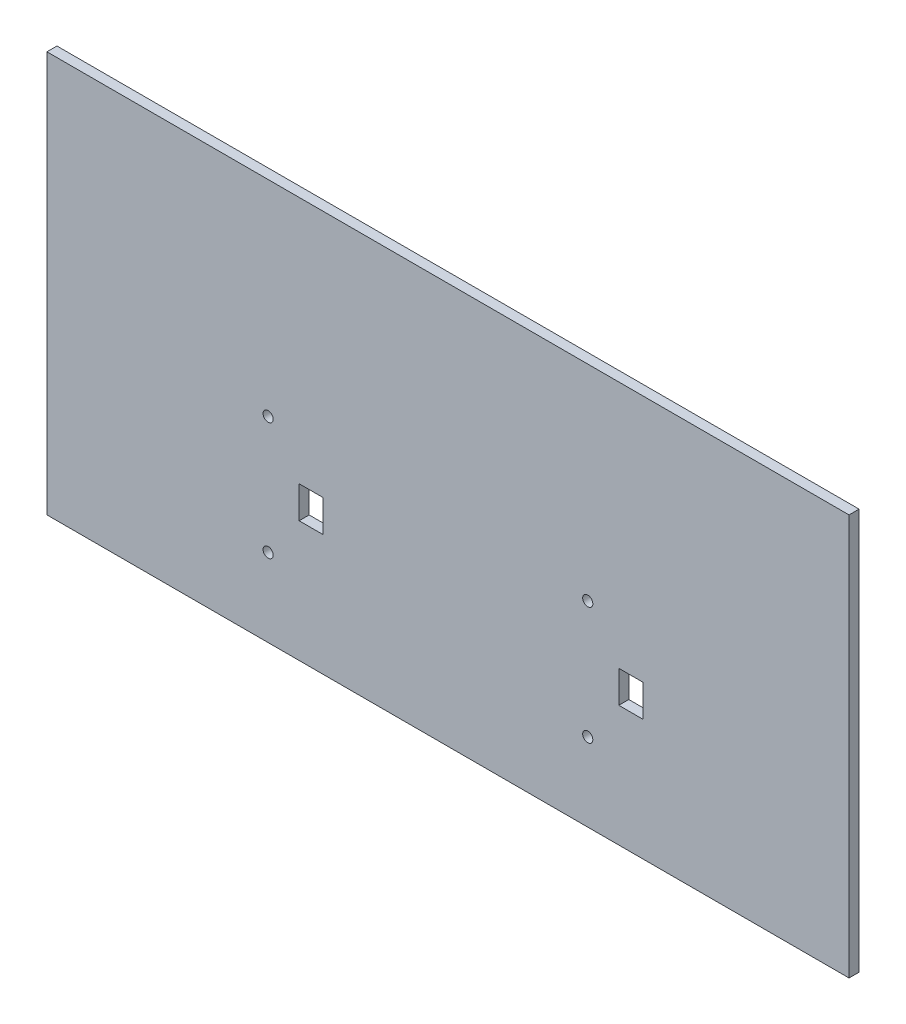
ISO-10303-21;
HEADER;
FILE_DESCRIPTION(('STEP AP214'),'2;1');
FILE_NAME('part.step','',(''),(''),'','','');
FILE_SCHEMA(('AUTOMOTIVE_DESIGN { 1 0 10303 214 1 1 1 1 }'));
ENDSEC;
DATA;
#1=APPLICATION_CONTEXT('core data for automotive mechanical design processes');
#2=APPLICATION_PROTOCOL_DEFINITION('international standard','automotive_design',2000,#1);
#3=PRODUCT_CONTEXT('',#1,'mechanical');
#4=PRODUCT('Part','Part','',(#3));
#5=PRODUCT_RELATED_PRODUCT_CATEGORY('part','',(#4));
#6=PRODUCT_DEFINITION_FORMATION('','',#4);
#7=PRODUCT_DEFINITION_CONTEXT('part definition',#1,'design');
#8=PRODUCT_DEFINITION('design','',#6,#7);
#9=PRODUCT_DEFINITION_SHAPE('','',#8);
#10=(LENGTH_UNIT() NAMED_UNIT(*) SI_UNIT(.MILLI.,.METRE.));
#11=(NAMED_UNIT(*) PLANE_ANGLE_UNIT() SI_UNIT($,.RADIAN.));
#12=(NAMED_UNIT(*) SI_UNIT($,.STERADIAN.) SOLID_ANGLE_UNIT());
#13=UNCERTAINTY_MEASURE_WITH_UNIT(LENGTH_MEASURE(1.E-05),#10,'distance_accuracy_value','');
#14=(GEOMETRIC_REPRESENTATION_CONTEXT(3) GLOBAL_UNCERTAINTY_ASSIGNED_CONTEXT((#13)) GLOBAL_UNIT_ASSIGNED_CONTEXT((#10,
#11,#12)) REPRESENTATION_CONTEXT('',''));
#15=CARTESIAN_POINT('',(0.,0.,0.));
#16=DIRECTION('',(0.,0.,1.));
#17=DIRECTION('',(1.,0.,0.));
#18=AXIS2_PLACEMENT_3D('',#15,#16,#17);
#19=CARTESIAN_POINT('',(127.,-63.5,1.5875));
#20=DIRECTION('',(-1.,0.,0.));
#21=DIRECTION('',(0.,0.,1.));
#22=AXIS2_PLACEMENT_3D('',#19,#20,#21);
#23=PLANE('',#22);
#24=DIRECTION('',(0.,1.,0.));
#25=VECTOR('',#24,1.);
#26=CARTESIAN_POINT('',(127.,-63.5,-1.5875));
#27=LINE('',#26,#25);
#28=CARTESIAN_POINT('',(127.,-63.5,-1.5875));
#29=VERTEX_POINT('',#28);
#30=CARTESIAN_POINT('',(127.,63.5,-1.5875));
#31=VERTEX_POINT('',#30);
#32=EDGE_CURVE('E194',#29,#31,#27,.T.);
#33=ORIENTED_EDGE('',*,*,#32,.T.);
#34=DIRECTION('',(0.,0.,-1.));
#35=VECTOR('',#34,1.);
#36=CARTESIAN_POINT('',(127.,63.5,1.5875));
#37=LINE('',#36,#35);
#38=CARTESIAN_POINT('',(127.,63.5,1.5875));
#39=VERTEX_POINT('',#38);
#40=EDGE_CURVE('E211',#39,#31,#37,.T.);
#41=ORIENTED_EDGE('',*,*,#40,.F.);
#42=DIRECTION('',(0.,1.,0.));
#43=VECTOR('',#42,1.);
#44=CARTESIAN_POINT('',(127.,-63.5,1.5875));
#45=LINE('',#44,#43);
#46=CARTESIAN_POINT('',(127.,-63.5,1.5875));
#47=VERTEX_POINT('',#46);
#48=EDGE_CURVE('E183',#47,#39,#45,.T.);
#49=ORIENTED_EDGE('',*,*,#48,.F.);
#50=DIRECTION('',(0.,0.,-1.));
#51=VECTOR('',#50,1.);
#52=CARTESIAN_POINT('',(127.,-63.5,1.5875));
#53=LINE('',#52,#51);
#54=EDGE_CURVE('E193',#47,#29,#53,.T.);
#55=ORIENTED_EDGE('',*,*,#54,.T.);
#56=EDGE_LOOP('',(#33,#41,#49,#55));
#57=FACE_BOUND('',#56,.T.);
#58=ADVANCED_FACE('F39',(#57),#23,.F.);
#59=CARTESIAN_POINT('',(-127.,63.5,1.5875));
#60=DIRECTION('',(0.,-1.,0.));
#61=DIRECTION('',(0.,0.,-1.));
#62=AXIS2_PLACEMENT_3D('',#59,#60,#61);
#63=PLANE('',#62);
#64=DIRECTION('',(-1.,0.,0.));
#65=VECTOR('',#64,1.);
#66=CARTESIAN_POINT('',(-127.,63.5,-1.5875));
#67=LINE('',#66,#65);
#68=CARTESIAN_POINT('',(-127.,63.5,-1.5875));
#69=VERTEX_POINT('',#68);
#70=EDGE_CURVE('E197',#31,#69,#67,.T.);
#71=ORIENTED_EDGE('',*,*,#70,.T.);
#72=DIRECTION('',(0.,0.,-1.));
#73=VECTOR('',#72,1.);
#74=CARTESIAN_POINT('',(-127.,63.5,1.5875));
#75=LINE('',#74,#73);
#76=CARTESIAN_POINT('',(-127.,63.5,1.5875));
#77=VERTEX_POINT('',#76);
#78=EDGE_CURVE('E208',#77,#69,#75,.T.);
#79=ORIENTED_EDGE('',*,*,#78,.F.);
#80=DIRECTION('',(-1.,0.,0.));
#81=VECTOR('',#80,1.);
#82=CARTESIAN_POINT('',(-127.,63.5,1.5875));
#83=LINE('',#82,#81);
#84=EDGE_CURVE('E186',#39,#77,#83,.T.);
#85=ORIENTED_EDGE('',*,*,#84,.F.);
#86=ORIENTED_EDGE('',*,*,#40,.T.);
#87=EDGE_LOOP('',(#71,#79,#85,#86));
#88=FACE_BOUND('',#87,.T.);
#89=ADVANCED_FACE('F270',(#88),#63,.F.);
#90=CARTESIAN_POINT('',(-127.,-63.5,1.5875));
#91=DIRECTION('',(1.,0.,0.));
#92=DIRECTION('',(0.,0.,-1.));
#93=AXIS2_PLACEMENT_3D('',#90,#91,#92);
#94=PLANE('',#93);
#95=DIRECTION('',(0.,-1.,0.));
#96=VECTOR('',#95,1.);
#97=CARTESIAN_POINT('',(-127.,-63.5,-1.5875));
#98=LINE('',#97,#96);
#99=CARTESIAN_POINT('',(-127.,-63.5,-1.5875));
#100=VERTEX_POINT('',#99);
#101=EDGE_CURVE('E200',#69,#100,#98,.T.);
#102=ORIENTED_EDGE('',*,*,#101,.T.);
#103=DIRECTION('',(0.,0.,-1.));
#104=VECTOR('',#103,1.);
#105=CARTESIAN_POINT('',(-127.,-63.5,1.5875));
#106=LINE('',#105,#104);
#107=CARTESIAN_POINT('',(-127.,-63.5,1.5875));
#108=VERTEX_POINT('',#107);
#109=EDGE_CURVE('E205',#108,#100,#106,.T.);
#110=ORIENTED_EDGE('',*,*,#109,.F.);
#111=DIRECTION('',(0.,-1.,0.));
#112=VECTOR('',#111,1.);
#113=CARTESIAN_POINT('',(-127.,-63.5,1.5875));
#114=LINE('',#113,#112);
#115=EDGE_CURVE('E189',#77,#108,#114,.T.);
#116=ORIENTED_EDGE('',*,*,#115,.F.);
#117=ORIENTED_EDGE('',*,*,#78,.T.);
#118=EDGE_LOOP('',(#102,#110,#116,#117));
#119=FACE_BOUND('',#118,.T.);
#120=ADVANCED_FACE('F265',(#119),#94,.F.);
#121=CARTESIAN_POINT('',(-127.,-63.5,1.5875));
#122=DIRECTION('',(0.,1.,0.));
#123=DIRECTION('',(0.,0.,1.));
#124=AXIS2_PLACEMENT_3D('',#121,#122,#123);
#125=PLANE('',#124);
#126=DIRECTION('',(1.,0.,0.));
#127=VECTOR('',#126,1.);
#128=CARTESIAN_POINT('',(-127.,-63.5,-1.5875));
#129=LINE('',#128,#127);
#130=EDGE_CURVE('E187',#100,#29,#129,.T.);
#131=ORIENTED_EDGE('',*,*,#130,.T.);
#132=ORIENTED_EDGE('',*,*,#54,.F.);
#133=DIRECTION('',(1.,0.,0.));
#134=VECTOR('',#133,1.);
#135=CARTESIAN_POINT('',(-127.,-63.5,1.5875));
#136=LINE('',#135,#134);
#137=EDGE_CURVE('E191',#108,#47,#136,.T.);
#138=ORIENTED_EDGE('',*,*,#137,.F.);
#139=ORIENTED_EDGE('',*,*,#109,.T.);
#140=EDGE_LOOP('',(#131,#132,#138,#139));
#141=FACE_BOUND('',#140,.T.);
#142=ADVANCED_FACE('F256',(#141),#125,.F.);
#143=CARTESIAN_POINT('',(0.,0.,1.5875));
#144=DIRECTION('',(0.,0.,-1.));
#145=DIRECTION('',(-1.,0.,0.));
#146=AXIS2_PLACEMENT_3D('',#143,#144,#145);
#147=PLANE('',#146);
#148=DIRECTION('',(0.,-1.,0.));
#149=VECTOR('',#148,1.);
#150=CARTESIAN_POINT('',(54.0800000012263,-15.025,1.5875));
#151=LINE('',#150,#149);
#152=CARTESIAN_POINT('',(54.0800000012263,-15.025,1.5875));
#153=VERTEX_POINT('',#152);
#154=CARTESIAN_POINT('',(54.0800000012264,-25.175,1.5875));
#155=VERTEX_POINT('',#154);
#156=EDGE_CURVE('E161',#153,#155,#151,.T.);
#157=ORIENTED_EDGE('',*,*,#156,.F.);
#158=DIRECTION('',(-1.,0.,0.));
#159=VECTOR('',#158,1.);
#160=CARTESIAN_POINT('',(54.0800000012263,-15.025,1.5875));
#161=LINE('',#160,#159);
#162=CARTESIAN_POINT('',(61.7000000012264,-15.025,1.5875));
#163=VERTEX_POINT('',#162);
#164=EDGE_CURVE('E53',#163,#153,#161,.T.);
#165=ORIENTED_EDGE('',*,*,#164,.F.);
#166=DIRECTION('',(0.,1.,0.));
#167=VECTOR('',#166,1.);
#168=CARTESIAN_POINT('',(61.7000000012264,-15.025,1.5875));
#169=LINE('',#168,#167);
#170=CARTESIAN_POINT('',(61.7000000012264,-25.175,1.5875));
#171=VERTEX_POINT('',#170);
#172=EDGE_CURVE('E167',#171,#163,#169,.T.);
#173=ORIENTED_EDGE('',*,*,#172,.F.);
#174=DIRECTION('',(1.,0.,0.));
#175=VECTOR('',#174,1.);
#176=CARTESIAN_POINT('',(54.0800000012264,-25.175,1.5875));
#177=LINE('',#176,#175);
#178=EDGE_CURVE('E164',#155,#171,#177,.T.);
#179=ORIENTED_EDGE('',*,*,#178,.F.);
#180=EDGE_LOOP('',(#157,#165,#173,#179));
#181=FACE_BOUND('',#180,.T.);
#182=DIRECTION('',(0.,1.,0.));
#183=VECTOR('',#182,1.);
#184=CARTESIAN_POINT('',(-39.5100000179999,-25.175,1.5875));
#185=LINE('',#184,#183);
#186=CARTESIAN_POINT('',(-39.5100000179999,-25.175,1.5875));
#187=VERTEX_POINT('',#186);
#188=CARTESIAN_POINT('',(-39.5100000179999,-15.025,1.5875));
#189=VERTEX_POINT('',#188);
#190=EDGE_CURVE('E143',#187,#189,#185,.T.);
#191=ORIENTED_EDGE('',*,*,#190,.F.);
#192=DIRECTION('',(1.,0.,0.));
#193=VECTOR('',#192,1.);
#194=CARTESIAN_POINT('',(-47.130000018,-25.175,1.5875));
#195=LINE('',#194,#193);
#196=CARTESIAN_POINT('',(-47.130000018,-25.175,1.5875));
#197=VERTEX_POINT('',#196);
#198=EDGE_CURVE('E61',#197,#187,#195,.T.);
#199=ORIENTED_EDGE('',*,*,#198,.F.);
#200=DIRECTION('',(0.,-1.,0.));
#201=VECTOR('',#200,1.);
#202=CARTESIAN_POINT('',(-47.130000018,-25.175,1.5875));
#203=LINE('',#202,#201);
#204=CARTESIAN_POINT('',(-47.130000018,-15.025,1.5875));
#205=VERTEX_POINT('',#204);
#206=EDGE_CURVE('E150',#205,#197,#203,.T.);
#207=ORIENTED_EDGE('',*,*,#206,.F.);
#208=DIRECTION('',(-1.,0.,0.));
#209=VECTOR('',#208,1.);
#210=CARTESIAN_POINT('',(-47.130000018,-15.025,1.5875));
#211=LINE('',#210,#209);
#212=EDGE_CURVE('E133',#189,#205,#211,.T.);
#213=ORIENTED_EDGE('',*,*,#212,.F.);
#214=EDGE_LOOP('',(#191,#199,#207,#213));
#215=FACE_BOUND('',#214,.T.);
#216=CARTESIAN_POINT('',(44.2550000102264,-1.46000000000007,1.5875));
#217=DIRECTION('',(0.,0.,1.));
#218=DIRECTION('',(1.,0.,0.));
#219=AXIS2_PLACEMENT_3D('',#216,#217,#218);
#220=CIRCLE('',#219,1.61);
#221=CARTESIAN_POINT('',(45.8650000102264,-1.46000000000007,1.5875));
#222=VERTEX_POINT('',#221);
#223=EDGE_CURVE('E157',#222,#222,#220,.T.);
#224=ORIENTED_EDGE('',*,*,#223,.F.);
#225=EDGE_LOOP('',(#224));
#226=FACE_BOUND('',#225,.T.);
#227=CARTESIAN_POINT('',(44.2550000102264,-38.74,1.5875));
#228=DIRECTION('',(0.,0.,1.));
#229=DIRECTION('',(1.,0.,0.));
#230=AXIS2_PLACEMENT_3D('',#227,#228,#229);
#231=CIRCLE('',#230,1.61);
#232=CARTESIAN_POINT('',(45.8650000102264,-38.74,1.5875));
#233=VERTEX_POINT('',#232);
#234=EDGE_CURVE('E422',#233,#233,#231,.T.);
#235=ORIENTED_EDGE('',*,*,#234,.F.);
#236=EDGE_LOOP('',(#235));
#237=FACE_BOUND('',#236,.T.);
#238=CARTESIAN_POINT('',(-56.9550000089999,-38.74,1.5875));
#239=DIRECTION('',(0.,0.,1.));
#240=DIRECTION('',(1.,0.,0.));
#241=AXIS2_PLACEMENT_3D('',#238,#239,#240);
#242=CIRCLE('',#241,1.61000000000001);
#243=CARTESIAN_POINT('',(-55.3450000089999,-38.74,1.5875));
#244=VERTEX_POINT('',#243);
#245=EDGE_CURVE('E182',#244,#244,#242,.T.);
#246=ORIENTED_EDGE('',*,*,#245,.F.);
#247=EDGE_LOOP('',(#246));
#248=FACE_BOUND('',#247,.T.);
#249=CARTESIAN_POINT('',(-56.9550000089999,-1.46000000000006,1.5875));
#250=DIRECTION('',(0.,0.,1.));
#251=DIRECTION('',(1.,0.,0.));
#252=AXIS2_PLACEMENT_3D('',#249,#250,#251);
#253=CIRCLE('',#252,1.61);
#254=CARTESIAN_POINT('',(-55.3450000089999,-1.46000000000006,1.5875));
#255=VERTEX_POINT('',#254);
#256=EDGE_CURVE('E178',#255,#255,#253,.T.);
#257=ORIENTED_EDGE('',*,*,#256,.F.);
#258=EDGE_LOOP('',(#257));
#259=FACE_BOUND('',#258,.T.);
#260=ORIENTED_EDGE('',*,*,#48,.T.);
#261=ORIENTED_EDGE('',*,*,#84,.T.);
#262=ORIENTED_EDGE('',*,*,#115,.T.);
#263=ORIENTED_EDGE('',*,*,#137,.T.);
#264=EDGE_LOOP('',(#260,#261,#262,#263));
#265=FACE_BOUND('',#264,.T.);
#266=ADVANCED_FACE('F147',(#181,#215,#226,#237,#248,#259,#265),#147,.F.);
#267=CARTESIAN_POINT('',(0.,0.,-1.5875));
#268=DIRECTION('',(0.,0.,-1.));
#269=DIRECTION('',(-1.,0.,0.));
#270=AXIS2_PLACEMENT_3D('',#267,#268,#269);
#271=PLANE('',#270);
#272=DIRECTION('',(1.,0.,0.));
#273=VECTOR('',#272,1.);
#274=CARTESIAN_POINT('',(0.,-15.0250000000001,-1.5875));
#275=LINE('',#274,#273);
#276=CARTESIAN_POINT('',(54.0800000012263,-15.025,-1.5875));
#277=VERTEX_POINT('',#276);
#278=CARTESIAN_POINT('',(61.7000000012264,-15.025,-1.5875));
#279=VERTEX_POINT('',#278);
#280=EDGE_CURVE('E11',#277,#279,#275,.T.);
#281=ORIENTED_EDGE('',*,*,#280,.F.);
#282=DIRECTION('',(0.,1.,0.));
#283=VECTOR('',#282,1.);
#284=CARTESIAN_POINT('',(54.0800000012263,0.,-1.5875));
#285=LINE('',#284,#283);
#286=CARTESIAN_POINT('',(54.0800000012264,-25.175,-1.5875));
#287=VERTEX_POINT('',#286);
#288=EDGE_CURVE('E231',#287,#277,#285,.T.);
#289=ORIENTED_EDGE('',*,*,#288,.F.);
#290=DIRECTION('',(-1.,0.,0.));
#291=VECTOR('',#290,1.);
#292=CARTESIAN_POINT('',(0.,-25.1750000000001,-1.5875));
#293=LINE('',#292,#291);
#294=CARTESIAN_POINT('',(61.7000000012264,-25.175,-1.5875));
#295=VERTEX_POINT('',#294);
#296=EDGE_CURVE('E233',#295,#287,#293,.T.);
#297=ORIENTED_EDGE('',*,*,#296,.F.);
#298=DIRECTION('',(0.,-1.,0.));
#299=VECTOR('',#298,1.);
#300=CARTESIAN_POINT('',(61.7000000012264,0.,-1.5875));
#301=LINE('',#300,#299);
#302=EDGE_CURVE('E46',#279,#295,#301,.T.);
#303=ORIENTED_EDGE('',*,*,#302,.F.);
#304=EDGE_LOOP('',(#281,#289,#297,#303));
#305=FACE_BOUND('',#304,.T.);
#306=DIRECTION('',(-1.,0.,0.));
#307=VECTOR('',#306,1.);
#308=CARTESIAN_POINT('',(0.,-25.175,-1.5875));
#309=LINE('',#308,#307);
#310=CARTESIAN_POINT('',(-39.5100000179999,-25.175,-1.5875));
#311=VERTEX_POINT('',#310);
#312=CARTESIAN_POINT('',(-47.130000018,-25.175,-1.5875));
#313=VERTEX_POINT('',#312);
#314=EDGE_CURVE('E229',#311,#313,#309,.T.);
#315=ORIENTED_EDGE('',*,*,#314,.F.);
#316=DIRECTION('',(0.,-1.,0.));
#317=VECTOR('',#316,1.);
#318=CARTESIAN_POINT('',(-39.5100000179999,0.,-1.5875));
#319=LINE('',#318,#317);
#320=CARTESIAN_POINT('',(-39.5100000179999,-15.025,-1.5875));
#321=VERTEX_POINT('',#320);
#322=EDGE_CURVE('E214',#321,#311,#319,.T.);
#323=ORIENTED_EDGE('',*,*,#322,.F.);
#324=DIRECTION('',(1.,0.,0.));
#325=VECTOR('',#324,1.);
#326=CARTESIAN_POINT('',(0.,-15.025,-1.5875));
#327=LINE('',#326,#325);
#328=CARTESIAN_POINT('',(-47.130000018,-15.025,-1.5875));
#329=VERTEX_POINT('',#328);
#330=EDGE_CURVE('E136',#329,#321,#327,.T.);
#331=ORIENTED_EDGE('',*,*,#330,.F.);
#332=DIRECTION('',(0.,1.,0.));
#333=VECTOR('',#332,1.);
#334=CARTESIAN_POINT('',(-47.130000018,0.,-1.5875));
#335=LINE('',#334,#333);
#336=EDGE_CURVE('E227',#313,#329,#335,.T.);
#337=ORIENTED_EDGE('',*,*,#336,.F.);
#338=EDGE_LOOP('',(#315,#323,#331,#337));
#339=FACE_BOUND('',#338,.T.);
#340=CARTESIAN_POINT('',(44.2550000102264,-1.46000000000007,-1.5875));
#341=DIRECTION('',(0.,0.,-1.));
#342=DIRECTION('',(-1.,0.,0.));
#343=AXIS2_PLACEMENT_3D('',#340,#341,#342);
#344=CIRCLE('',#343,1.61);
#345=CARTESIAN_POINT('',(42.6450000102264,-1.46000000000007,-1.5875));
#346=VERTEX_POINT('',#345);
#347=EDGE_CURVE('E198',#346,#346,#344,.T.);
#348=ORIENTED_EDGE('',*,*,#347,.F.);
#349=EDGE_LOOP('',(#348));
#350=FACE_BOUND('',#349,.T.);
#351=CARTESIAN_POINT('',(44.2550000102264,-38.74,-1.5875));
#352=DIRECTION('',(0.,0.,-1.));
#353=DIRECTION('',(-1.,0.,0.));
#354=AXIS2_PLACEMENT_3D('',#351,#352,#353);
#355=CIRCLE('',#354,1.61);
#356=CARTESIAN_POINT('',(42.6450000102264,-38.74,-1.5875));
#357=VERTEX_POINT('',#356);
#358=EDGE_CURVE('E220',#357,#357,#355,.T.);
#359=ORIENTED_EDGE('',*,*,#358,.F.);
#360=EDGE_LOOP('',(#359));
#361=FACE_BOUND('',#360,.T.);
#362=CARTESIAN_POINT('',(-56.9550000089999,-38.74,-1.5875));
#363=DIRECTION('',(0.,0.,-1.));
#364=DIRECTION('',(-1.,0.,0.));
#365=AXIS2_PLACEMENT_3D('',#362,#363,#364);
#366=CIRCLE('',#365,1.61000000000001);
#367=CARTESIAN_POINT('',(-58.5650000089999,-38.74,-1.5875));
#368=VERTEX_POINT('',#367);
#369=EDGE_CURVE('E217',#368,#368,#366,.T.);
#370=ORIENTED_EDGE('',*,*,#369,.F.);
#371=EDGE_LOOP('',(#370));
#372=FACE_BOUND('',#371,.T.);
#373=CARTESIAN_POINT('',(-56.9550000089999,-1.46000000000006,-1.5875));
#374=DIRECTION('',(0.,0.,-1.));
#375=DIRECTION('',(-1.,0.,0.));
#376=AXIS2_PLACEMENT_3D('',#373,#374,#375);
#377=CIRCLE('',#376,1.61);
#378=CARTESIAN_POINT('',(-58.5650000089999,-1.46000000000006,-1.5875));
#379=VERTEX_POINT('',#378);
#380=EDGE_CURVE('E181',#379,#379,#377,.T.);
#381=ORIENTED_EDGE('',*,*,#380,.F.);
#382=EDGE_LOOP('',(#381));
#383=FACE_BOUND('',#382,.T.);
#384=ORIENTED_EDGE('',*,*,#32,.F.);
#385=ORIENTED_EDGE('',*,*,#130,.F.);
#386=ORIENTED_EDGE('',*,*,#101,.F.);
#387=ORIENTED_EDGE('',*,*,#70,.F.);
#388=EDGE_LOOP('',(#384,#385,#386,#387));
#389=FACE_BOUND('',#388,.T.);
#390=ADVANCED_FACE('F248',(#305,#339,#350,#361,#372,#383,#389),#271,.T.);
#391=CARTESIAN_POINT('',(-56.9550000089999,-1.46000000000006,-3.4925));
#392=DIRECTION('',(0.,0.,1.));
#393=DIRECTION('',(1.,0.,0.));
#394=AXIS2_PLACEMENT_3D('',#391,#392,#393);
#395=CYLINDRICAL_SURFACE('',#394,1.61);
#396=ORIENTED_EDGE('',*,*,#380,.T.);
#397=EDGE_LOOP('',(#396));
#398=FACE_BOUND('',#397,.T.);
#399=ORIENTED_EDGE('',*,*,#256,.T.);
#400=EDGE_LOOP('',(#399));
#401=FACE_BOUND('',#400,.T.);
#402=ADVANCED_FACE('F262',(#398,#401),#395,.F.);
#403=CARTESIAN_POINT('',(-56.9550000089999,-38.74,-3.4925));
#404=DIRECTION('',(0.,0.,1.));
#405=DIRECTION('',(1.,0.,0.));
#406=AXIS2_PLACEMENT_3D('',#403,#404,#405);
#407=CYLINDRICAL_SURFACE('',#406,1.61000000000001);
#408=ORIENTED_EDGE('',*,*,#369,.T.);
#409=EDGE_LOOP('',(#408));
#410=FACE_BOUND('',#409,.T.);
#411=ORIENTED_EDGE('',*,*,#245,.T.);
#412=EDGE_LOOP('',(#411));
#413=FACE_BOUND('',#412,.T.);
#414=ADVANCED_FACE('F315',(#410,#413),#407,.F.);
#415=CARTESIAN_POINT('',(44.2550000102264,-38.74,-3.4925));
#416=DIRECTION('',(0.,0.,1.));
#417=DIRECTION('',(1.,0.,0.));
#418=AXIS2_PLACEMENT_3D('',#415,#416,#417);
#419=CYLINDRICAL_SURFACE('',#418,1.61);
#420=ORIENTED_EDGE('',*,*,#358,.T.);
#421=EDGE_LOOP('',(#420));
#422=FACE_BOUND('',#421,.T.);
#423=ORIENTED_EDGE('',*,*,#234,.T.);
#424=EDGE_LOOP('',(#423));
#425=FACE_BOUND('',#424,.T.);
#426=ADVANCED_FACE('F321',(#422,#425),#419,.F.);
#427=CARTESIAN_POINT('',(44.2550000102264,-1.46000000000007,-3.4925));
#428=DIRECTION('',(0.,0.,1.));
#429=DIRECTION('',(1.,0.,0.));
#430=AXIS2_PLACEMENT_3D('',#427,#428,#429);
#431=CYLINDRICAL_SURFACE('',#430,1.61);
#432=ORIENTED_EDGE('',*,*,#347,.T.);
#433=EDGE_LOOP('',(#432));
#434=FACE_BOUND('',#433,.T.);
#435=ORIENTED_EDGE('',*,*,#223,.T.);
#436=EDGE_LOOP('',(#435));
#437=FACE_BOUND('',#436,.T.);
#438=ADVANCED_FACE('F329',(#434,#437),#431,.F.);
#439=CARTESIAN_POINT('',(-47.130000018,-25.175,-3.4925));
#440=DIRECTION('',(0.,-1.,0.));
#441=DIRECTION('',(0.,0.,-1.));
#442=AXIS2_PLACEMENT_3D('',#439,#440,#441);
#443=PLANE('',#442);
#444=ORIENTED_EDGE('',*,*,#314,.T.);
#445=DIRECTION('',(0.,0.,1.));
#446=VECTOR('',#445,1.);
#447=CARTESIAN_POINT('',(-47.130000018,-25.175,-3.4925));
#448=LINE('',#447,#446);
#449=EDGE_CURVE('E155',#313,#197,#448,.T.);
#450=ORIENTED_EDGE('',*,*,#449,.T.);
#451=ORIENTED_EDGE('',*,*,#198,.T.);
#452=DIRECTION('',(0.,0.,1.));
#453=VECTOR('',#452,1.);
#454=CARTESIAN_POINT('',(-39.5100000179999,-25.175,-3.4925));
#455=LINE('',#454,#453);
#456=EDGE_CURVE('E140',#311,#187,#455,.T.);
#457=ORIENTED_EDGE('',*,*,#456,.F.);
#458=EDGE_LOOP('',(#444,#450,#451,#457));
#459=FACE_BOUND('',#458,.T.);
#460=ADVANCED_FACE('F337',(#459),#443,.F.);
#461=CARTESIAN_POINT('',(-47.130000018,-25.175,-3.4925));
#462=DIRECTION('',(-1.,0.,0.));
#463=DIRECTION('',(0.,0.,1.));
#464=AXIS2_PLACEMENT_3D('',#461,#462,#463);
#465=PLANE('',#464);
#466=ORIENTED_EDGE('',*,*,#336,.T.);
#467=DIRECTION('',(0.,0.,1.));
#468=VECTOR('',#467,1.);
#469=CARTESIAN_POINT('',(-47.130000018,-15.025,-3.4925));
#470=LINE('',#469,#468);
#471=EDGE_CURVE('E139',#329,#205,#470,.T.);
#472=ORIENTED_EDGE('',*,*,#471,.T.);
#473=ORIENTED_EDGE('',*,*,#206,.T.);
#474=ORIENTED_EDGE('',*,*,#449,.F.);
#475=EDGE_LOOP('',(#466,#472,#473,#474));
#476=FACE_BOUND('',#475,.T.);
#477=ADVANCED_FACE('F345',(#476),#465,.F.);
#478=CARTESIAN_POINT('',(-47.130000018,-15.025,-3.4925));
#479=DIRECTION('',(0.,1.,0.));
#480=DIRECTION('',(0.,0.,1.));
#481=AXIS2_PLACEMENT_3D('',#478,#479,#480);
#482=PLANE('',#481);
#483=ORIENTED_EDGE('',*,*,#330,.T.);
#484=DIRECTION('',(0.,0.,1.));
#485=VECTOR('',#484,1.);
#486=CARTESIAN_POINT('',(-39.5100000179999,-15.025,-3.4925));
#487=LINE('',#486,#485);
#488=EDGE_CURVE('E128',#321,#189,#487,.T.);
#489=ORIENTED_EDGE('',*,*,#488,.T.);
#490=ORIENTED_EDGE('',*,*,#212,.T.);
#491=ORIENTED_EDGE('',*,*,#471,.F.);
#492=EDGE_LOOP('',(#483,#489,#490,#491));
#493=FACE_BOUND('',#492,.T.);
#494=ADVANCED_FACE('F130',(#493),#482,.F.);
#495=CARTESIAN_POINT('',(-39.5100000179999,-25.175,-3.4925));
#496=DIRECTION('',(1.,0.,0.));
#497=DIRECTION('',(0.,0.,-1.));
#498=AXIS2_PLACEMENT_3D('',#495,#496,#497);
#499=PLANE('',#498);
#500=ORIENTED_EDGE('',*,*,#322,.T.);
#501=ORIENTED_EDGE('',*,*,#456,.T.);
#502=ORIENTED_EDGE('',*,*,#190,.T.);
#503=ORIENTED_EDGE('',*,*,#488,.F.);
#504=EDGE_LOOP('',(#500,#501,#502,#503));
#505=FACE_BOUND('',#504,.T.);
#506=ADVANCED_FACE('F144',(#505),#499,.F.);
#507=CARTESIAN_POINT('',(54.0800000012263,-15.025,-3.4925));
#508=DIRECTION('',(0.,1.,0.));
#509=DIRECTION('',(-1.,0.,0.));
#510=AXIS2_PLACEMENT_3D('',#507,#508,#509);
#511=PLANE('',#510);
#512=ORIENTED_EDGE('',*,*,#280,.T.);
#513=DIRECTION('',(0.,0.,1.));
#514=VECTOR('',#513,1.);
#515=CARTESIAN_POINT('',(61.7000000012264,-15.025,-3.4925));
#516=LINE('',#515,#514);
#517=EDGE_CURVE('E171',#279,#163,#516,.T.);
#518=ORIENTED_EDGE('',*,*,#517,.T.);
#519=ORIENTED_EDGE('',*,*,#164,.T.);
#520=DIRECTION('',(0.,0.,1.));
#521=VECTOR('',#520,1.);
#522=CARTESIAN_POINT('',(54.0800000012263,-15.025,-3.4925));
#523=LINE('',#522,#521);
#524=EDGE_CURVE('E170',#277,#153,#523,.T.);
#525=ORIENTED_EDGE('',*,*,#524,.F.);
#526=EDGE_LOOP('',(#512,#518,#519,#525));
#527=FACE_BOUND('',#526,.T.);
#528=ADVANCED_FACE('F253',(#527),#511,.F.);
#529=CARTESIAN_POINT('',(61.7000000012264,-15.025,-3.4925));
#530=DIRECTION('',(1.,0.,0.));
#531=DIRECTION('',(0.,0.,-1.));
#532=AXIS2_PLACEMENT_3D('',#529,#530,#531);
#533=PLANE('',#532);
#534=ORIENTED_EDGE('',*,*,#302,.T.);
#535=DIRECTION('',(0.,0.,1.));
#536=VECTOR('',#535,1.);
#537=CARTESIAN_POINT('',(61.7000000012264,-25.175,-3.4925));
#538=LINE('',#537,#536);
#539=EDGE_CURVE('E173',#295,#171,#538,.T.);
#540=ORIENTED_EDGE('',*,*,#539,.T.);
#541=ORIENTED_EDGE('',*,*,#172,.T.);
#542=ORIENTED_EDGE('',*,*,#517,.F.);
#543=EDGE_LOOP('',(#534,#540,#541,#542));
#544=FACE_BOUND('',#543,.T.);
#545=ADVANCED_FACE('F239',(#544),#533,.F.);
#546=CARTESIAN_POINT('',(54.0800000012264,-25.175,-3.4925));
#547=DIRECTION('',(0.,-1.,0.));
#548=DIRECTION('',(1.,0.,0.));
#549=AXIS2_PLACEMENT_3D('',#546,#547,#548);
#550=PLANE('',#549);
#551=ORIENTED_EDGE('',*,*,#296,.T.);
#552=DIRECTION('',(0.,0.,1.));
#553=VECTOR('',#552,1.);
#554=CARTESIAN_POINT('',(54.0800000012264,-25.175,-3.4925));
#555=LINE('',#554,#553);
#556=EDGE_CURVE('E175',#287,#155,#555,.T.);
#557=ORIENTED_EDGE('',*,*,#556,.T.);
#558=ORIENTED_EDGE('',*,*,#178,.T.);
#559=ORIENTED_EDGE('',*,*,#539,.F.);
#560=EDGE_LOOP('',(#551,#557,#558,#559));
#561=FACE_BOUND('',#560,.T.);
#562=ADVANCED_FACE('F244',(#561),#550,.F.);
#563=CARTESIAN_POINT('',(54.0800000012263,-15.025,-3.4925));
#564=DIRECTION('',(-1.,0.,0.));
#565=DIRECTION('',(0.,-1.,0.));
#566=AXIS2_PLACEMENT_3D('',#563,#564,#565);
#567=PLANE('',#566);
#568=ORIENTED_EDGE('',*,*,#288,.T.);
#569=ORIENTED_EDGE('',*,*,#524,.T.);
#570=ORIENTED_EDGE('',*,*,#156,.T.);
#571=ORIENTED_EDGE('',*,*,#556,.F.);
#572=EDGE_LOOP('',(#568,#569,#570,#571));
#573=FACE_BOUND('',#572,.T.);
#574=ADVANCED_FACE('F251',(#573),#567,.F.);
#575=CLOSED_SHELL('',(#58,#89,#120,#142,#266,#390,#402,#414,#426,#438,#460,#477,#494,#506,#528,
#545,#562,#574));
#576=MANIFOLD_SOLID_BREP('B2',#575);
#577=ADVANCED_BREP_SHAPE_REPRESENTATION('',(#18,#576),#14);
#578=SHAPE_DEFINITION_REPRESENTATION(#9,#577);
ENDSEC;
END-ISO-10303-21;
